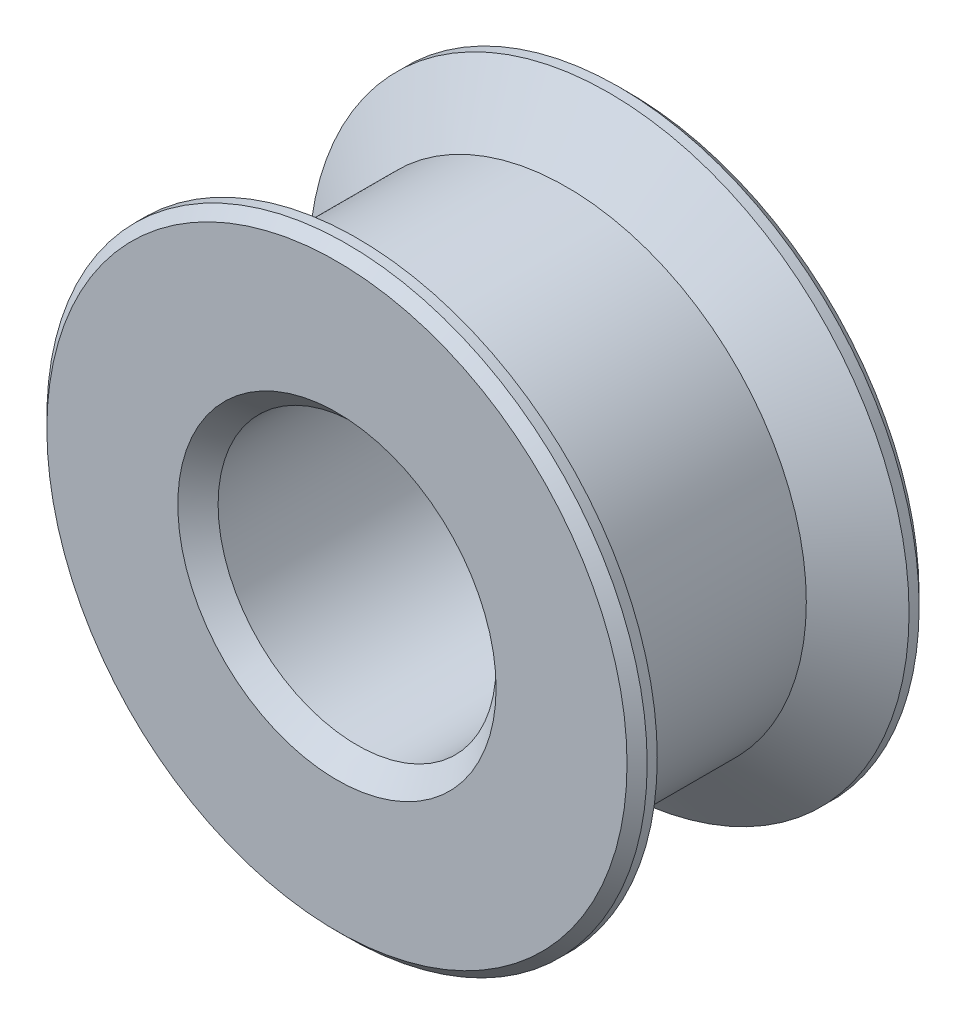
ISO-10303-21;
HEADER;
FILE_DESCRIPTION(('STEP AP214'),'2;1');
FILE_NAME('part.step','',(''),(''),'','','');
FILE_SCHEMA(('AUTOMOTIVE_DESIGN { 1 0 10303 214 1 1 1 1 }'));
ENDSEC;
DATA;
#1=APPLICATION_CONTEXT('core data for automotive mechanical design processes');
#2=APPLICATION_PROTOCOL_DEFINITION('international standard','automotive_design',2000,#1);
#3=PRODUCT_CONTEXT('',#1,'mechanical');
#4=PRODUCT('Part','Part','',(#3));
#5=PRODUCT_RELATED_PRODUCT_CATEGORY('part','',(#4));
#6=PRODUCT_DEFINITION_FORMATION('','',#4);
#7=PRODUCT_DEFINITION_CONTEXT('part definition',#1,'design');
#8=PRODUCT_DEFINITION('design','',#6,#7);
#9=PRODUCT_DEFINITION_SHAPE('','',#8);
#10=(LENGTH_UNIT() NAMED_UNIT(*) SI_UNIT(.MILLI.,.METRE.));
#11=(NAMED_UNIT(*) PLANE_ANGLE_UNIT() SI_UNIT($,.RADIAN.));
#12=(NAMED_UNIT(*) SI_UNIT($,.STERADIAN.) SOLID_ANGLE_UNIT());
#13=UNCERTAINTY_MEASURE_WITH_UNIT(LENGTH_MEASURE(1.E-05),#10,'distance_accuracy_value','');
#14=(GEOMETRIC_REPRESENTATION_CONTEXT(3) GLOBAL_UNCERTAINTY_ASSIGNED_CONTEXT((#13)) GLOBAL_UNIT_ASSIGNED_CONTEXT((#10,
#11,#12)) REPRESENTATION_CONTEXT('',''));
#15=CARTESIAN_POINT('',(0.,0.,0.));
#16=DIRECTION('',(0.,0.,1.));
#17=DIRECTION('',(1.,0.,0.));
#18=AXIS2_PLACEMENT_3D('',#15,#16,#17);
#19=CARTESIAN_POINT('',(0.,0.,6.25));
#20=DIRECTION('',(0.,0.,-1.));
#21=DIRECTION('',(-1.,0.,0.));
#22=AXIS2_PLACEMENT_3D('',#19,#20,#21);
#23=CYLINDRICAL_SURFACE('',#22,11.9);
#24=CARTESIAN_POINT('',(0.,0.,4.14937738537088));
#25=DIRECTION('',(0.,0.,1.));
#26=DIRECTION('',(1.,0.,0.));
#27=AXIS2_PLACEMENT_3D('',#24,#25,#26);
#28=CIRCLE('',#27,11.9);
#29=CARTESIAN_POINT('',(11.9,0.,4.14937738537088));
#30=VERTEX_POINT('',#29);
#31=EDGE_CURVE('E68',#30,#30,#28,.F.);
#32=ORIENTED_EDGE('',*,*,#31,.T.);
#33=EDGE_LOOP('',(#32));
#34=FACE_BOUND('',#33,.T.);
#35=CARTESIAN_POINT('',(0.,0.,-4.14937738537088));
#36=DIRECTION('',(0.,0.,-1.));
#37=DIRECTION('',(-1.,0.,0.));
#38=AXIS2_PLACEMENT_3D('',#35,#36,#37);
#39=CIRCLE('',#38,11.9);
#40=CARTESIAN_POINT('',(-11.9,0.,-4.14937738537088));
#41=VERTEX_POINT('',#40);
#42=EDGE_CURVE('E71',#41,#41,#39,.F.);
#43=ORIENTED_EDGE('',*,*,#42,.T.);
#44=EDGE_LOOP('',(#43));
#45=FACE_BOUND('',#44,.T.);
#46=ADVANCED_FACE('F35',(#34,#45),#23,.T.);
#47=CARTESIAN_POINT('',(0.,0.,6.25));
#48=DIRECTION('',(0.,0.,-1.));
#49=DIRECTION('',(-1.,0.,0.));
#50=AXIS2_PLACEMENT_3D('',#47,#48,#49);
#51=CYLINDRICAL_SURFACE('',#50,6.9);
#52=CARTESIAN_POINT('',(0.,0.,-6.25));
#53=DIRECTION('',(0.,0.,-1.));
#54=DIRECTION('',(-1.,0.,0.));
#55=AXIS2_PLACEMENT_3D('',#52,#53,#54);
#56=CIRCLE('',#55,6.9);
#57=CARTESIAN_POINT('',(-6.9,0.,-6.25));
#58=VERTEX_POINT('',#57);
#59=EDGE_CURVE('E43',#58,#58,#56,.T.);
#60=ORIENTED_EDGE('',*,*,#59,.T.);
#61=EDGE_LOOP('',(#60));
#62=FACE_BOUND('',#61,.T.);
#63=CARTESIAN_POINT('',(0.,0.,6.25000000000001));
#64=DIRECTION('',(0.,0.,1.));
#65=DIRECTION('',(1.,0.,0.));
#66=AXIS2_PLACEMENT_3D('',#63,#64,#65);
#67=CIRCLE('',#66,6.9);
#68=CARTESIAN_POINT('',(6.9,0.,6.25000000000001));
#69=VERTEX_POINT('',#68);
#70=EDGE_CURVE('E47',#69,#69,#67,.T.);
#71=ORIENTED_EDGE('',*,*,#70,.T.);
#72=EDGE_LOOP('',(#71));
#73=FACE_BOUND('',#72,.T.);
#74=ADVANCED_FACE('F102',(#62,#73),#51,.F.);
#75=CARTESIAN_POINT('',(0.,0.,7.25));
#76=DIRECTION('',(0.,0.,1.));
#77=DIRECTION('',(1.,0.,0.));
#78=AXIS2_PLACEMENT_3D('',#75,#76,#77);
#79=PLANE('',#78);
#80=CARTESIAN_POINT('',(0.,0.,7.25));
#81=DIRECTION('',(0.,0.,1.));
#82=DIRECTION('',(1.,0.,0.));
#83=AXIS2_PLACEMENT_3D('',#80,#81,#82);
#84=CIRCLE('',#83,7.9);
#85=CARTESIAN_POINT('',(7.9,0.,7.25));
#86=VERTEX_POINT('',#85);
#87=EDGE_CURVE('E10',#86,#86,#84,.F.);
#88=ORIENTED_EDGE('',*,*,#87,.T.);
#89=EDGE_LOOP('',(#88));
#90=FACE_BOUND('',#89,.T.);
#91=CARTESIAN_POINT('',(0.,0.,7.25));
#92=DIRECTION('',(0.,0.,1.));
#93=DIRECTION('',(1.,0.,0.));
#94=AXIS2_PLACEMENT_3D('',#91,#92,#93);
#95=CIRCLE('',#94,14.4);
#96=CARTESIAN_POINT('',(14.4,0.,7.25));
#97=VERTEX_POINT('',#96);
#98=EDGE_CURVE('E65',#97,#97,#95,.T.);
#99=ORIENTED_EDGE('',*,*,#98,.T.);
#100=EDGE_LOOP('',(#99));
#101=FACE_BOUND('',#100,.T.);
#102=ADVANCED_FACE('F97',(#90,#101),#79,.T.);
#103=CARTESIAN_POINT('',(0.,0.,7.25));
#104=DIRECTION('',(0.,0.,-1.));
#105=DIRECTION('',(-1.,0.,0.));
#106=AXIS2_PLACEMENT_3D('',#103,#104,#105);
#107=CYLINDRICAL_SURFACE('',#106,14.9);
#108=CARTESIAN_POINT('',(0.,0.,6.75000000000001));
#109=DIRECTION('',(0.,0.,1.));
#110=DIRECTION('',(1.,0.,0.));
#111=AXIS2_PLACEMENT_3D('',#108,#109,#110);
#112=CIRCLE('',#111,14.9);
#113=CARTESIAN_POINT('',(14.9,0.,6.75000000000001));
#114=VERTEX_POINT('',#113);
#115=EDGE_CURVE('E62',#114,#114,#112,.F.);
#116=ORIENTED_EDGE('',*,*,#115,.T.);
#117=EDGE_LOOP('',(#116));
#118=FACE_BOUND('',#117,.T.);
#119=CARTESIAN_POINT('',(0.,0.,6.25));
#120=DIRECTION('',(0.,0.,1.));
#121=DIRECTION('',(1.,0.,0.));
#122=AXIS2_PLACEMENT_3D('',#119,#120,#121);
#123=CIRCLE('',#122,14.9);
#124=CARTESIAN_POINT('',(14.9,0.,6.25));
#125=VERTEX_POINT('',#124);
#126=EDGE_CURVE('E74',#125,#125,#123,.T.);
#127=ORIENTED_EDGE('',*,*,#126,.T.);
#128=EDGE_LOOP('',(#127));
#129=FACE_BOUND('',#128,.T.);
#130=ADVANCED_FACE('F87',(#118,#129),#107,.T.);
#131=CARTESIAN_POINT('',(0.,0.,-7.25));
#132=DIRECTION('',(0.,0.,1.));
#133=DIRECTION('',(1.,0.,0.));
#134=AXIS2_PLACEMENT_3D('',#131,#132,#133);
#135=CYLINDRICAL_SURFACE('',#134,14.9);
#136=CARTESIAN_POINT('',(0.,0.,-6.75));
#137=DIRECTION('',(0.,0.,-1.));
#138=DIRECTION('',(-1.,0.,0.));
#139=AXIS2_PLACEMENT_3D('',#136,#137,#138);
#140=CIRCLE('',#139,14.9);
#141=CARTESIAN_POINT('',(-14.9,0.,-6.75));
#142=VERTEX_POINT('',#141);
#143=EDGE_CURVE('E59',#142,#142,#140,.F.);
#144=ORIENTED_EDGE('',*,*,#143,.T.);
#145=EDGE_LOOP('',(#144));
#146=FACE_BOUND('',#145,.T.);
#147=CARTESIAN_POINT('',(0.,0.,-6.25));
#148=DIRECTION('',(0.,0.,1.));
#149=DIRECTION('',(1.,0.,0.));
#150=AXIS2_PLACEMENT_3D('',#147,#148,#149);
#151=CIRCLE('',#150,14.9);
#152=CARTESIAN_POINT('',(14.9,0.,-6.25));
#153=VERTEX_POINT('',#152);
#154=EDGE_CURVE('E77',#153,#153,#151,.T.);
#155=ORIENTED_EDGE('',*,*,#154,.F.);
#156=EDGE_LOOP('',(#155));
#157=FACE_BOUND('',#156,.T.);
#158=ADVANCED_FACE('F84',(#146,#157),#135,.T.);
#159=CARTESIAN_POINT('',(0.,0.,-7.25));
#160=DIRECTION('',(0.,0.,-1.));
#161=DIRECTION('',(1.,0.,0.));
#162=AXIS2_PLACEMENT_3D('',#159,#160,#161);
#163=PLANE('',#162);
#164=CARTESIAN_POINT('',(0.,0.,-7.25));
#165=DIRECTION('',(0.,0.,-1.));
#166=DIRECTION('',(-1.,0.,0.));
#167=AXIS2_PLACEMENT_3D('',#164,#165,#166);
#168=CIRCLE('',#167,7.9);
#169=CARTESIAN_POINT('',(-7.9,0.,-7.25));
#170=VERTEX_POINT('',#169);
#171=EDGE_CURVE('E51',#170,#170,#168,.F.);
#172=ORIENTED_EDGE('',*,*,#171,.T.);
#173=EDGE_LOOP('',(#172));
#174=FACE_BOUND('',#173,.T.);
#175=CARTESIAN_POINT('',(0.,0.,-7.25));
#176=DIRECTION('',(0.,0.,-1.));
#177=DIRECTION('',(-1.,0.,0.));
#178=AXIS2_PLACEMENT_3D('',#175,#176,#177);
#179=CIRCLE('',#178,14.4);
#180=CARTESIAN_POINT('',(-14.4,0.,-7.25));
#181=VERTEX_POINT('',#180);
#182=EDGE_CURVE('E56',#181,#181,#179,.T.);
#183=ORIENTED_EDGE('',*,*,#182,.T.);
#184=EDGE_LOOP('',(#183));
#185=FACE_BOUND('',#184,.T.);
#186=ADVANCED_FACE('F86',(#174,#185),#163,.T.);
#187=CARTESIAN_POINT('',(0.,0.,6.25));
#188=DIRECTION('',(0.,0.,1.));
#189=DIRECTION('',(1.,0.,0.));
#190=AXIS2_PLACEMENT_3D('',#187,#188,#189);
#191=CONICAL_SURFACE('',#190,14.9,0.959931088596876);
#192=ORIENTED_EDGE('',*,*,#31,.F.);
#193=EDGE_LOOP('',(#192));
#194=FACE_BOUND('',#193,.T.);
#195=ORIENTED_EDGE('',*,*,#126,.F.);
#196=EDGE_LOOP('',(#195));
#197=FACE_BOUND('',#196,.T.);
#198=ADVANCED_FACE('F94',(#194,#197),#191,.T.);
#199=CARTESIAN_POINT('',(0.,0.,-4.14937738537088));
#200=DIRECTION('',(0.,0.,-1.));
#201=DIRECTION('',(-1.,0.,0.));
#202=AXIS2_PLACEMENT_3D('',#199,#200,#201);
#203=CONICAL_SURFACE('',#202,11.9,0.959931088596876);
#204=ORIENTED_EDGE('',*,*,#154,.T.);
#205=EDGE_LOOP('',(#204));
#206=FACE_BOUND('',#205,.T.);
#207=ORIENTED_EDGE('',*,*,#42,.F.);
#208=EDGE_LOOP('',(#207));
#209=FACE_BOUND('',#208,.T.);
#210=ADVANCED_FACE('F81',(#206,#209),#203,.T.);
#211=CARTESIAN_POINT('',(0.,0.,7.25));
#212=DIRECTION('',(0.,0.,-1.));
#213=DIRECTION('',(-1.,0.,0.));
#214=AXIS2_PLACEMENT_3D('',#211,#212,#213);
#215=CONICAL_SURFACE('',#214,14.4,0.785398163397445);
#216=ORIENTED_EDGE('',*,*,#115,.F.);
#217=EDGE_LOOP('',(#216));
#218=FACE_BOUND('',#217,.T.);
#219=ORIENTED_EDGE('',*,*,#98,.F.);
#220=EDGE_LOOP('',(#219));
#221=FACE_BOUND('',#220,.T.);
#222=ADVANCED_FACE('F123',(#218,#221),#215,.T.);
#223=CARTESIAN_POINT('',(0.,0.,-6.75));
#224=DIRECTION('',(0.,0.,1.));
#225=DIRECTION('',(1.,0.,0.));
#226=AXIS2_PLACEMENT_3D('',#223,#224,#225);
#227=CONICAL_SURFACE('',#226,14.9,0.785398163397447);
#228=ORIENTED_EDGE('',*,*,#182,.F.);
#229=EDGE_LOOP('',(#228));
#230=FACE_BOUND('',#229,.T.);
#231=ORIENTED_EDGE('',*,*,#143,.F.);
#232=EDGE_LOOP('',(#231));
#233=FACE_BOUND('',#232,.T.);
#234=ADVANCED_FACE('F129',(#230,#233),#227,.T.);
#235=CARTESIAN_POINT('',(0.,0.,-7.25));
#236=DIRECTION('',(0.,0.,-1.));
#237=DIRECTION('',(-1.,0.,0.));
#238=AXIS2_PLACEMENT_3D('',#235,#236,#237);
#239=CONICAL_SURFACE('',#238,7.9,0.785398163397446);
#240=ORIENTED_EDGE('',*,*,#59,.F.);
#241=EDGE_LOOP('',(#240));
#242=FACE_BOUND('',#241,.T.);
#243=ORIENTED_EDGE('',*,*,#171,.F.);
#244=EDGE_LOOP('',(#243));
#245=FACE_BOUND('',#244,.T.);
#246=ADVANCED_FACE('F135',(#242,#245),#239,.F.);
#247=CARTESIAN_POINT('',(0.,0.,6.25000000000001));
#248=DIRECTION('',(0.,0.,1.));
#249=DIRECTION('',(1.,0.,0.));
#250=AXIS2_PLACEMENT_3D('',#247,#248,#249);
#251=CONICAL_SURFACE('',#250,6.9,0.78539816339745);
#252=ORIENTED_EDGE('',*,*,#87,.F.);
#253=EDGE_LOOP('',(#252));
#254=FACE_BOUND('',#253,.T.);
#255=ORIENTED_EDGE('',*,*,#70,.F.);
#256=EDGE_LOOP('',(#255));
#257=FACE_BOUND('',#256,.T.);
#258=ADVANCED_FACE('F38',(#254,#257),#251,.F.);
#259=CLOSED_SHELL('',(#46,#74,#102,#130,#158,#186,#198,#210,#222,#234,#246,#258));
#260=MANIFOLD_SOLID_BREP('B2',#259);
#261=ADVANCED_BREP_SHAPE_REPRESENTATION('',(#18,#260),#14);
#262=SHAPE_DEFINITION_REPRESENTATION(#9,#261);
ENDSEC;
END-ISO-10303-21;
